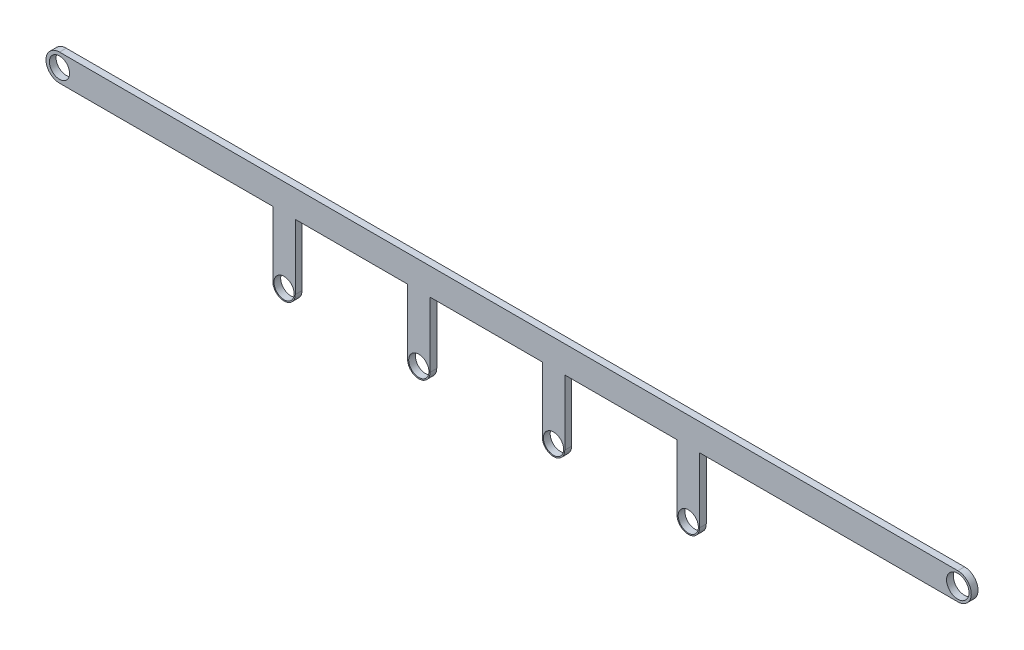
ISO-10303-21;
HEADER;
FILE_DESCRIPTION(('STEP AP214'),'2;1');
FILE_NAME('part.step','',(''),(''),'','','');
FILE_SCHEMA(('AUTOMOTIVE_DESIGN { 1 0 10303 214 1 1 1 1 }'));
ENDSEC;
DATA;
#1=APPLICATION_CONTEXT('core data for automotive mechanical design processes');
#2=APPLICATION_PROTOCOL_DEFINITION('international standard','automotive_design',2000,#1);
#3=PRODUCT_CONTEXT('',#1,'mechanical');
#4=PRODUCT('Part','Part','',(#3));
#5=PRODUCT_RELATED_PRODUCT_CATEGORY('part','',(#4));
#6=PRODUCT_DEFINITION_FORMATION('','',#4);
#7=PRODUCT_DEFINITION_CONTEXT('part definition',#1,'design');
#8=PRODUCT_DEFINITION('design','',#6,#7);
#9=PRODUCT_DEFINITION_SHAPE('','',#8);
#10=(LENGTH_UNIT() NAMED_UNIT(*) SI_UNIT(.MILLI.,.METRE.));
#11=(NAMED_UNIT(*) PLANE_ANGLE_UNIT() SI_UNIT($,.RADIAN.));
#12=(NAMED_UNIT(*) SI_UNIT($,.STERADIAN.) SOLID_ANGLE_UNIT());
#13=UNCERTAINTY_MEASURE_WITH_UNIT(LENGTH_MEASURE(1.E-05),#10,'distance_accuracy_value','');
#14=(GEOMETRIC_REPRESENTATION_CONTEXT(3) GLOBAL_UNCERTAINTY_ASSIGNED_CONTEXT((#13)) GLOBAL_UNIT_ASSIGNED_CONTEXT((#10,
#11,#12)) REPRESENTATION_CONTEXT('',''));
#15=CARTESIAN_POINT('',(0.,0.,0.));
#16=DIRECTION('',(0.,0.,1.));
#17=DIRECTION('',(1.,0.,0.));
#18=AXIS2_PLACEMENT_3D('',#15,#16,#17);
#19=CARTESIAN_POINT('',(159.999999999998,-35.0000000000009,3.));
#20=DIRECTION('',(0.,0.,-1.));
#21=DIRECTION('',(-1.,0.,0.));
#22=AXIS2_PLACEMENT_3D('',#19,#20,#21);
#23=CYLINDRICAL_SURFACE('',#22,4.50000000000002);
#24=CARTESIAN_POINT('',(159.999999999998,-35.0000000000009,3.));
#25=DIRECTION('',(0.,0.,1.));
#26=DIRECTION('',(1.,0.,0.));
#27=AXIS2_PLACEMENT_3D('',#24,#25,#26);
#28=CIRCLE('',#27,4.50000000000002);
#29=CARTESIAN_POINT('',(164.499999999998,-35.0000000000009,3.));
#30=VERTEX_POINT('',#29);
#31=EDGE_CURVE('E574',#30,#30,#28,.T.);
#32=ORIENTED_EDGE('',*,*,#31,.T.);
#33=EDGE_LOOP('',(#32));
#34=FACE_BOUND('',#33,.T.);
#35=CARTESIAN_POINT('',(159.999999999998,-35.0000000000009,0.));
#36=DIRECTION('',(0.,0.,1.));
#37=DIRECTION('',(1.,0.,0.));
#38=AXIS2_PLACEMENT_3D('',#35,#36,#37);
#39=CIRCLE('',#38,4.50000000000002);
#40=CARTESIAN_POINT('',(164.499999999998,-35.0000000000009,0.));
#41=VERTEX_POINT('',#40);
#42=EDGE_CURVE('E575',#41,#41,#39,.T.);
#43=ORIENTED_EDGE('',*,*,#42,.F.);
#44=EDGE_LOOP('',(#43));
#45=FACE_BOUND('',#44,.T.);
#46=ADVANCED_FACE('F345',(#34,#45),#23,.F.);
#47=CARTESIAN_POINT('',(219.999999999998,-35.0000000000004,3.));
#48=DIRECTION('',(0.,0.,-1.));
#49=DIRECTION('',(-1.,0.,0.));
#50=AXIS2_PLACEMENT_3D('',#47,#48,#49);
#51=CYLINDRICAL_SURFACE('',#50,4.50000000000002);
#52=CARTESIAN_POINT('',(219.999999999998,-35.0000000000004,3.));
#53=DIRECTION('',(0.,0.,1.));
#54=DIRECTION('',(1.,0.,0.));
#55=AXIS2_PLACEMENT_3D('',#52,#53,#54);
#56=CIRCLE('',#55,4.50000000000002);
#57=CARTESIAN_POINT('',(224.499999999998,-35.0000000000004,3.));
#58=VERTEX_POINT('',#57);
#59=EDGE_CURVE('E644',#58,#58,#56,.T.);
#60=ORIENTED_EDGE('',*,*,#59,.T.);
#61=EDGE_LOOP('',(#60));
#62=FACE_BOUND('',#61,.T.);
#63=CARTESIAN_POINT('',(219.999999999998,-35.0000000000004,0.));
#64=DIRECTION('',(0.,0.,1.));
#65=DIRECTION('',(1.,0.,0.));
#66=AXIS2_PLACEMENT_3D('',#63,#64,#65);
#67=CIRCLE('',#66,4.50000000000002);
#68=CARTESIAN_POINT('',(224.499999999998,-35.0000000000004,0.));
#69=VERTEX_POINT('',#68);
#70=EDGE_CURVE('E580',#69,#69,#67,.T.);
#71=ORIENTED_EDGE('',*,*,#70,.F.);
#72=EDGE_LOOP('',(#71));
#73=FACE_BOUND('',#72,.T.);
#74=ADVANCED_FACE('F827',(#62,#73),#51,.F.);
#75=CARTESIAN_POINT('',(0.,0.,3.));
#76=DIRECTION('',(0.,0.,-1.));
#77=DIRECTION('',(-1.,0.,0.));
#78=AXIS2_PLACEMENT_3D('',#75,#76,#77);
#79=CYLINDRICAL_SURFACE('',#78,4.5);
#80=CARTESIAN_POINT('',(0.,0.,3.));
#81=DIRECTION('',(0.,0.,1.));
#82=DIRECTION('',(1.,0.,0.));
#83=AXIS2_PLACEMENT_3D('',#80,#81,#82);
#84=CIRCLE('',#83,4.5);
#85=CARTESIAN_POINT('',(4.5,0.,3.));
#86=VERTEX_POINT('',#85);
#87=EDGE_CURVE('E648',#86,#86,#84,.T.);
#88=ORIENTED_EDGE('',*,*,#87,.T.);
#89=EDGE_LOOP('',(#88));
#90=FACE_BOUND('',#89,.T.);
#91=CARTESIAN_POINT('',(0.,0.,0.));
#92=DIRECTION('',(0.,0.,1.));
#93=DIRECTION('',(1.,0.,0.));
#94=AXIS2_PLACEMENT_3D('',#91,#92,#93);
#95=CIRCLE('',#94,4.5);
#96=CARTESIAN_POINT('',(4.5,0.,0.));
#97=VERTEX_POINT('',#96);
#98=EDGE_CURVE('E584',#97,#97,#95,.T.);
#99=ORIENTED_EDGE('',*,*,#98,.F.);
#100=EDGE_LOOP('',(#99));
#101=FACE_BOUND('',#100,.T.);
#102=ADVANCED_FACE('F833',(#90,#101),#79,.F.);
#103=CARTESIAN_POINT('',(400.,0.,3.));
#104=DIRECTION('',(0.,0.,-1.));
#105=DIRECTION('',(-1.,0.,0.));
#106=AXIS2_PLACEMENT_3D('',#103,#104,#105);
#107=CYLINDRICAL_SURFACE('',#106,5.00000000006176);
#108=CARTESIAN_POINT('',(400.,0.,3.));
#109=DIRECTION('',(0.,0.,1.));
#110=DIRECTION('',(1.,0.,0.));
#111=AXIS2_PLACEMENT_3D('',#108,#109,#110);
#112=CIRCLE('',#111,5.00000000006176);
#113=CARTESIAN_POINT('',(405.000000000062,0.,3.));
#114=VERTEX_POINT('',#113);
#115=EDGE_CURVE('E652',#114,#114,#112,.T.);
#116=ORIENTED_EDGE('',*,*,#115,.T.);
#117=EDGE_LOOP('',(#116));
#118=FACE_BOUND('',#117,.T.);
#119=CARTESIAN_POINT('',(400.,0.,0.));
#120=DIRECTION('',(0.,0.,1.));
#121=DIRECTION('',(1.,0.,0.));
#122=AXIS2_PLACEMENT_3D('',#119,#120,#121);
#123=CIRCLE('',#122,5.00000000006176);
#124=CARTESIAN_POINT('',(405.000000000062,0.,0.));
#125=VERTEX_POINT('',#124);
#126=EDGE_CURVE('E588',#125,#125,#123,.T.);
#127=ORIENTED_EDGE('',*,*,#126,.F.);
#128=EDGE_LOOP('',(#127));
#129=FACE_BOUND('',#128,.T.);
#130=ADVANCED_FACE('F842',(#118,#129),#107,.F.);
#131=CARTESIAN_POINT('',(154.999999999999,-9.83340393239419E-13,3.));
#132=DIRECTION('',(1.,0.,0.));
#133=DIRECTION('',(0.,1.,0.));
#134=AXIS2_PLACEMENT_3D('',#131,#132,#133);
#135=PLANE('',#134);
#136=DIRECTION('',(0.,-1.,0.));
#137=VECTOR('',#136,1.);
#138=CARTESIAN_POINT('',(154.999999999999,-9.83340393239419E-13,0.));
#139=LINE('',#138,#137);
#140=CARTESIAN_POINT('',(154.999999999999,-6.,0.));
#141=VERTEX_POINT('',#140);
#142=CARTESIAN_POINT('',(154.999999999999,-35.0000000000009,0.));
#143=VERTEX_POINT('',#142);
#144=EDGE_CURVE('E635',#141,#143,#139,.T.);
#145=ORIENTED_EDGE('',*,*,#144,.T.);
#146=DIRECTION('',(0.,0.,-1.));
#147=VECTOR('',#146,1.);
#148=CARTESIAN_POINT('',(154.999999999999,-35.0000000000009,3.));
#149=LINE('',#148,#147);
#150=CARTESIAN_POINT('',(154.999999999999,-35.0000000000009,3.));
#151=VERTEX_POINT('',#150);
#152=EDGE_CURVE('E356',#151,#143,#149,.T.);
#153=ORIENTED_EDGE('',*,*,#152,.F.);
#154=DIRECTION('',(0.,-1.,0.));
#155=VECTOR('',#154,1.);
#156=CARTESIAN_POINT('',(154.999999999999,-9.83340393239419E-13,3.));
#157=LINE('',#156,#155);
#158=CARTESIAN_POINT('',(154.999999999999,-6.,3.));
#159=VERTEX_POINT('',#158);
#160=EDGE_CURVE('E704',#159,#151,#157,.T.);
#161=ORIENTED_EDGE('',*,*,#160,.F.);
#162=DIRECTION('',(0.,0.,-1.));
#163=VECTOR('',#162,1.);
#164=CARTESIAN_POINT('',(154.999999999999,-6.,3.));
#165=LINE('',#164,#163);
#166=EDGE_CURVE('E12',#159,#141,#165,.T.);
#167=ORIENTED_EDGE('',*,*,#166,.T.);
#168=EDGE_LOOP('',(#145,#153,#161,#167));
#169=FACE_BOUND('',#168,.T.);
#170=ADVANCED_FACE('F722',(#169),#135,.F.);
#171=CARTESIAN_POINT('',(159.999999999998,-35.0000000000009,3.));
#172=DIRECTION('',(0.,0.,-1.));
#173=DIRECTION('',(-1.,0.,0.));
#174=AXIS2_PLACEMENT_3D('',#171,#172,#173);
#175=CYLINDRICAL_SURFACE('',#174,4.99999999999934);
#176=CARTESIAN_POINT('',(159.999999999998,-35.0000000000009,0.));
#177=DIRECTION('',(0.,0.,1.));
#178=DIRECTION('',(1.,0.,0.));
#179=AXIS2_PLACEMENT_3D('',#176,#177,#178);
#180=CIRCLE('',#179,4.99999999999934);
#181=CARTESIAN_POINT('',(164.999999999998,-35.0000000000008,0.));
#182=VERTEX_POINT('',#181);
#183=EDGE_CURVE('E631',#143,#182,#180,.T.);
#184=ORIENTED_EDGE('',*,*,#183,.T.);
#185=DIRECTION('',(0.,0.,-1.));
#186=VECTOR('',#185,1.);
#187=CARTESIAN_POINT('',(164.999999999998,-35.0000000000008,3.));
#188=LINE('',#187,#186);
#189=CARTESIAN_POINT('',(164.999999999998,-35.0000000000008,3.));
#190=VERTEX_POINT('',#189);
#191=EDGE_CURVE('E530',#190,#182,#188,.T.);
#192=ORIENTED_EDGE('',*,*,#191,.F.);
#193=CARTESIAN_POINT('',(159.999999999998,-35.0000000000009,3.));
#194=DIRECTION('',(0.,0.,1.));
#195=DIRECTION('',(1.,0.,0.));
#196=AXIS2_PLACEMENT_3D('',#193,#194,#195);
#197=CIRCLE('',#196,4.99999999999934);
#198=EDGE_CURVE('E700',#151,#190,#197,.T.);
#199=ORIENTED_EDGE('',*,*,#198,.F.);
#200=ORIENTED_EDGE('',*,*,#152,.T.);
#201=EDGE_LOOP('',(#184,#192,#199,#200));
#202=FACE_BOUND('',#201,.T.);
#203=ADVANCED_FACE('F729',(#202),#175,.T.);
#204=CARTESIAN_POINT('',(164.999999999997,3.14034512679682E-12,3.));
#205=DIRECTION('',(1.,0.,0.));
#206=DIRECTION('',(0.,1.,0.));
#207=AXIS2_PLACEMENT_3D('',#204,#205,#206);
#208=PLANE('',#207);
#209=DIRECTION('',(0.,-1.,0.));
#210=VECTOR('',#209,1.);
#211=CARTESIAN_POINT('',(164.999999999997,3.14034512679682E-12,0.));
#212=LINE('',#211,#210);
#213=CARTESIAN_POINT('',(164.999999999997,-5.99999999999999,0.));
#214=VERTEX_POINT('',#213);
#215=EDGE_CURVE('E627',#214,#182,#212,.T.);
#216=ORIENTED_EDGE('',*,*,#215,.F.);
#217=DIRECTION('',(0.,0.,-1.));
#218=VECTOR('',#217,1.);
#219=CARTESIAN_POINT('',(164.999999999997,-5.99999999999999,3.));
#220=LINE('',#219,#218);
#221=CARTESIAN_POINT('',(164.999999999997,-5.99999999999999,3.));
#222=VERTEX_POINT('',#221);
#223=EDGE_CURVE('E533',#222,#214,#220,.T.);
#224=ORIENTED_EDGE('',*,*,#223,.F.);
#225=DIRECTION('',(0.,-1.,0.));
#226=VECTOR('',#225,1.);
#227=CARTESIAN_POINT('',(164.999999999997,3.14034512679682E-12,3.));
#228=LINE('',#227,#226);
#229=EDGE_CURVE('E696',#222,#190,#228,.T.);
#230=ORIENTED_EDGE('',*,*,#229,.T.);
#231=ORIENTED_EDGE('',*,*,#191,.T.);
#232=EDGE_LOOP('',(#216,#224,#230,#231));
#233=FACE_BOUND('',#232,.T.);
#234=ADVANCED_FACE('F771',(#233),#208,.T.);
#235=CARTESIAN_POINT('',(0.,-6.00000000000001,3.));
#236=DIRECTION('',(0.,1.,0.));
#237=DIRECTION('',(-1.,0.,0.));
#238=AXIS2_PLACEMENT_3D('',#235,#236,#237);
#239=PLANE('',#238);
#240=DIRECTION('',(1.,0.,0.));
#241=VECTOR('',#240,1.);
#242=CARTESIAN_POINT('',(0.,-6.00000000000001,0.));
#243=LINE('',#242,#241);
#244=CARTESIAN_POINT('',(214.999999999999,-5.99999999999999,0.));
#245=VERTEX_POINT('',#244);
#246=EDGE_CURVE('E624',#214,#245,#243,.T.);
#247=ORIENTED_EDGE('',*,*,#246,.T.);
#248=DIRECTION('',(0.,0.,-1.));
#249=VECTOR('',#248,1.);
#250=CARTESIAN_POINT('',(214.999999999999,-5.99999999999999,3.));
#251=LINE('',#250,#249);
#252=CARTESIAN_POINT('',(214.999999999999,-5.99999999999999,3.));
#253=VERTEX_POINT('',#252);
#254=EDGE_CURVE('E536',#253,#245,#251,.T.);
#255=ORIENTED_EDGE('',*,*,#254,.F.);
#256=DIRECTION('',(1.,0.,0.));
#257=VECTOR('',#256,1.);
#258=CARTESIAN_POINT('',(0.,-6.00000000000001,3.));
#259=LINE('',#258,#257);
#260=EDGE_CURVE('E692',#222,#253,#259,.T.);
#261=ORIENTED_EDGE('',*,*,#260,.F.);
#262=ORIENTED_EDGE('',*,*,#223,.T.);
#263=EDGE_LOOP('',(#247,#255,#261,#262));
#264=FACE_BOUND('',#263,.T.);
#265=ADVANCED_FACE('F775',(#264),#239,.F.);
#266=CARTESIAN_POINT('',(214.999999999999,-1.36398828739662E-12,3.));
#267=DIRECTION('',(1.,0.,0.));
#268=DIRECTION('',(0.,1.,0.));
#269=AXIS2_PLACEMENT_3D('',#266,#267,#268);
#270=PLANE('',#269);
#271=DIRECTION('',(0.,-1.,0.));
#272=VECTOR('',#271,1.);
#273=CARTESIAN_POINT('',(214.999999999999,-1.36398828739662E-12,0.));
#274=LINE('',#273,#272);
#275=CARTESIAN_POINT('',(214.999999999999,-35.0000000000004,0.));
#276=VERTEX_POINT('',#275);
#277=EDGE_CURVE('E621',#245,#276,#274,.T.);
#278=ORIENTED_EDGE('',*,*,#277,.T.);
#279=DIRECTION('',(0.,0.,-1.));
#280=VECTOR('',#279,1.);
#281=CARTESIAN_POINT('',(214.999999999999,-35.0000000000004,3.));
#282=LINE('',#281,#280);
#283=CARTESIAN_POINT('',(214.999999999999,-35.0000000000004,3.));
#284=VERTEX_POINT('',#283);
#285=EDGE_CURVE('E540',#284,#276,#282,.T.);
#286=ORIENTED_EDGE('',*,*,#285,.F.);
#287=DIRECTION('',(0.,-1.,0.));
#288=VECTOR('',#287,1.);
#289=CARTESIAN_POINT('',(214.999999999999,-1.36398828739662E-12,3.));
#290=LINE('',#289,#288);
#291=EDGE_CURVE('E688',#253,#284,#290,.T.);
#292=ORIENTED_EDGE('',*,*,#291,.F.);
#293=ORIENTED_EDGE('',*,*,#254,.T.);
#294=EDGE_LOOP('',(#278,#286,#292,#293));
#295=FACE_BOUND('',#294,.T.);
#296=ADVANCED_FACE('F782',(#295),#270,.F.);
#297=CARTESIAN_POINT('',(219.999999999998,-35.0000000000004,3.));
#298=DIRECTION('',(0.,0.,-1.));
#299=DIRECTION('',(-1.,0.,0.));
#300=AXIS2_PLACEMENT_3D('',#297,#298,#299);
#301=CYLINDRICAL_SURFACE('',#300,4.99999999999934);
#302=CARTESIAN_POINT('',(219.999999999998,-35.0000000000004,0.));
#303=DIRECTION('',(0.,0.,1.));
#304=DIRECTION('',(1.,0.,0.));
#305=AXIS2_PLACEMENT_3D('',#302,#303,#304);
#306=CIRCLE('',#305,4.99999999999934);
#307=CARTESIAN_POINT('',(224.999999999998,-35.0000000000004,0.));
#308=VERTEX_POINT('',#307);
#309=EDGE_CURVE('E617',#276,#308,#306,.T.);
#310=ORIENTED_EDGE('',*,*,#309,.T.);
#311=DIRECTION('',(0.,0.,-1.));
#312=VECTOR('',#311,1.);
#313=CARTESIAN_POINT('',(224.999999999998,-35.0000000000004,3.));
#314=LINE('',#313,#312);
#315=CARTESIAN_POINT('',(224.999999999998,-35.0000000000004,3.));
#316=VERTEX_POINT('',#315);
#317=EDGE_CURVE('E544',#316,#308,#314,.T.);
#318=ORIENTED_EDGE('',*,*,#317,.F.);
#319=CARTESIAN_POINT('',(219.999999999998,-35.0000000000004,3.));
#320=DIRECTION('',(0.,0.,1.));
#321=DIRECTION('',(1.,0.,0.));
#322=AXIS2_PLACEMENT_3D('',#319,#320,#321);
#323=CIRCLE('',#322,4.99999999999934);
#324=EDGE_CURVE('E684',#284,#316,#323,.T.);
#325=ORIENTED_EDGE('',*,*,#324,.F.);
#326=ORIENTED_EDGE('',*,*,#285,.T.);
#327=EDGE_LOOP('',(#310,#318,#325,#326));
#328=FACE_BOUND('',#327,.T.);
#329=ADVANCED_FACE('F785',(#328),#301,.T.);
#330=CARTESIAN_POINT('',(224.999999999997,4.28228880926841E-12,3.));
#331=DIRECTION('',(1.,0.,0.));
#332=DIRECTION('',(0.,1.,0.));
#333=AXIS2_PLACEMENT_3D('',#330,#331,#332);
#334=PLANE('',#333);
#335=DIRECTION('',(0.,-1.,0.));
#336=VECTOR('',#335,1.);
#337=CARTESIAN_POINT('',(224.999999999997,4.28228880926841E-12,0.));
#338=LINE('',#337,#336);
#339=CARTESIAN_POINT('',(224.999999999997,-5.99999999999999,0.));
#340=VERTEX_POINT('',#339);
#341=EDGE_CURVE('E613',#340,#308,#338,.T.);
#342=ORIENTED_EDGE('',*,*,#341,.F.);
#343=DIRECTION('',(0.,0.,-1.));
#344=VECTOR('',#343,1.);
#345=CARTESIAN_POINT('',(224.999999999997,-5.99999999999999,3.));
#346=LINE('',#345,#344);
#347=CARTESIAN_POINT('',(224.999999999997,-5.99999999999999,3.));
#348=VERTEX_POINT('',#347);
#349=EDGE_CURVE('E547',#348,#340,#346,.T.);
#350=ORIENTED_EDGE('',*,*,#349,.F.);
#351=DIRECTION('',(0.,-1.,0.));
#352=VECTOR('',#351,1.);
#353=CARTESIAN_POINT('',(224.999999999997,4.28228880926841E-12,3.));
#354=LINE('',#353,#352);
#355=EDGE_CURVE('E680',#348,#316,#354,.T.);
#356=ORIENTED_EDGE('',*,*,#355,.T.);
#357=ORIENTED_EDGE('',*,*,#317,.T.);
#358=EDGE_LOOP('',(#342,#350,#356,#357));
#359=FACE_BOUND('',#358,.T.);
#360=ADVANCED_FACE('F788',(#359),#334,.T.);
#361=CARTESIAN_POINT('',(0.,-6.00000000000001,3.));
#362=DIRECTION('',(0.,1.,0.));
#363=DIRECTION('',(-1.,0.,0.));
#364=AXIS2_PLACEMENT_3D('',#361,#362,#363);
#365=PLANE('',#364);
#366=DIRECTION('',(1.,0.,0.));
#367=VECTOR('',#366,1.);
#368=CARTESIAN_POINT('',(0.,-6.00000000000001,0.));
#369=LINE('',#368,#367);
#370=CARTESIAN_POINT('',(274.999999999999,-5.99999999999999,0.));
#371=VERTEX_POINT('',#370);
#372=EDGE_CURVE('E609',#340,#371,#369,.T.);
#373=ORIENTED_EDGE('',*,*,#372,.T.);
#374=DIRECTION('',(0.,0.,-1.));
#375=VECTOR('',#374,1.);
#376=CARTESIAN_POINT('',(274.999999999999,-5.99999999999999,3.));
#377=LINE('',#376,#375);
#378=CARTESIAN_POINT('',(274.999999999999,-5.99999999999999,3.));
#379=VERTEX_POINT('',#378);
#380=EDGE_CURVE('E550',#379,#371,#377,.T.);
#381=ORIENTED_EDGE('',*,*,#380,.F.);
#382=DIRECTION('',(1.,0.,0.));
#383=VECTOR('',#382,1.);
#384=CARTESIAN_POINT('',(0.,-6.00000000000001,3.));
#385=LINE('',#384,#383);
#386=EDGE_CURVE('E676',#348,#379,#385,.T.);
#387=ORIENTED_EDGE('',*,*,#386,.F.);
#388=ORIENTED_EDGE('',*,*,#349,.T.);
#389=EDGE_LOOP('',(#373,#381,#387,#388));
#390=FACE_BOUND('',#389,.T.);
#391=ADVANCED_FACE('F793',(#390),#365,.F.);
#392=CARTESIAN_POINT('',(0.,-5.99999999999999,3.));
#393=DIRECTION('',(0.,1.,0.));
#394=DIRECTION('',(0.,0.,1.));
#395=AXIS2_PLACEMENT_3D('',#392,#393,#394);
#396=PLANE('',#395);
#397=DIRECTION('',(1.,0.,0.));
#398=VECTOR('',#397,1.);
#399=CARTESIAN_POINT('',(0.,-5.99999999999999,0.));
#400=LINE('',#399,#398);
#401=CARTESIAN_POINT('',(284.999999999997,-5.99999999999999,0.));
#402=VERTEX_POINT('',#401);
#403=CARTESIAN_POINT('',(400.,-5.99999999999999,0.));
#404=VERTEX_POINT('',#403);
#405=EDGE_CURVE('E606',#402,#404,#400,.T.);
#406=ORIENTED_EDGE('',*,*,#405,.T.);
#407=DIRECTION('',(0.,0.,-1.));
#408=VECTOR('',#407,1.);
#409=CARTESIAN_POINT('',(400.,-5.99999999999999,3.));
#410=LINE('',#409,#408);
#411=CARTESIAN_POINT('',(400.,-5.99999999999999,3.));
#412=VERTEX_POINT('',#411);
#413=EDGE_CURVE('E556',#412,#404,#410,.T.);
#414=ORIENTED_EDGE('',*,*,#413,.F.);
#415=DIRECTION('',(1.,0.,0.));
#416=VECTOR('',#415,1.);
#417=CARTESIAN_POINT('',(0.,-5.99999999999999,3.));
#418=LINE('',#417,#416);
#419=CARTESIAN_POINT('',(284.999999999997,-5.99999999999999,3.));
#420=VERTEX_POINT('',#419);
#421=EDGE_CURVE('E672',#420,#412,#418,.T.);
#422=ORIENTED_EDGE('',*,*,#421,.F.);
#423=DIRECTION('',(0.,0.,-1.));
#424=VECTOR('',#423,1.);
#425=CARTESIAN_POINT('',(284.999999999997,-5.99999999999999,3.));
#426=LINE('',#425,#424);
#427=EDGE_CURVE('E553',#420,#402,#426,.T.);
#428=ORIENTED_EDGE('',*,*,#427,.T.);
#429=EDGE_LOOP('',(#406,#414,#422,#428));
#430=FACE_BOUND('',#429,.T.);
#431=ADVANCED_FACE('F807',(#430),#396,.F.);
#432=CARTESIAN_POINT('',(400.,0.,3.));
#433=DIRECTION('',(0.,0.,-1.));
#434=DIRECTION('',(-1.,0.,0.));
#435=AXIS2_PLACEMENT_3D('',#432,#433,#434);
#436=CYLINDRICAL_SURFACE('',#435,6.);
#437=CARTESIAN_POINT('',(400.,0.,0.));
#438=DIRECTION('',(0.,0.,1.));
#439=DIRECTION('',(1.,0.,0.));
#440=AXIS2_PLACEMENT_3D('',#437,#438,#439);
#441=CIRCLE('',#440,6.);
#442=CARTESIAN_POINT('',(400.,6.00000000000002,0.));
#443=VERTEX_POINT('',#442);
#444=EDGE_CURVE('E602',#404,#443,#441,.T.);
#445=ORIENTED_EDGE('',*,*,#444,.T.);
#446=DIRECTION('',(0.,0.,-1.));
#447=VECTOR('',#446,1.);
#448=CARTESIAN_POINT('',(400.,6.00000000000002,3.));
#449=LINE('',#448,#447);
#450=CARTESIAN_POINT('',(400.,6.00000000000002,3.));
#451=VERTEX_POINT('',#450);
#452=EDGE_CURVE('E560',#451,#443,#449,.T.);
#453=ORIENTED_EDGE('',*,*,#452,.F.);
#454=CARTESIAN_POINT('',(400.,0.,3.));
#455=DIRECTION('',(0.,0.,1.));
#456=DIRECTION('',(1.,0.,0.));
#457=AXIS2_PLACEMENT_3D('',#454,#455,#456);
#458=CIRCLE('',#457,6.);
#459=EDGE_CURVE('E668',#412,#451,#458,.T.);
#460=ORIENTED_EDGE('',*,*,#459,.F.);
#461=ORIENTED_EDGE('',*,*,#413,.T.);
#462=EDGE_LOOP('',(#445,#453,#460,#461));
#463=FACE_BOUND('',#462,.T.);
#464=ADVANCED_FACE('F814',(#463),#436,.T.);
#465=CARTESIAN_POINT('',(0.,6.00000000000002,3.));
#466=DIRECTION('',(0.,1.,0.));
#467=DIRECTION('',(0.,0.,1.));
#468=AXIS2_PLACEMENT_3D('',#465,#466,#467);
#469=PLANE('',#468);
#470=DIRECTION('',(1.,0.,0.));
#471=VECTOR('',#470,1.);
#472=CARTESIAN_POINT('',(0.,6.00000000000002,0.));
#473=LINE('',#472,#471);
#474=CARTESIAN_POINT('',(0.,6.00000000000002,0.));
#475=VERTEX_POINT('',#474);
#476=EDGE_CURVE('E598',#475,#443,#473,.T.);
#477=ORIENTED_EDGE('',*,*,#476,.F.);
#478=DIRECTION('',(0.,0.,-1.));
#479=VECTOR('',#478,1.);
#480=CARTESIAN_POINT('',(0.,6.00000000000002,3.));
#481=LINE('',#480,#479);
#482=CARTESIAN_POINT('',(0.,6.00000000000002,3.));
#483=VERTEX_POINT('',#482);
#484=EDGE_CURVE('E563',#483,#475,#481,.T.);
#485=ORIENTED_EDGE('',*,*,#484,.F.);
#486=DIRECTION('',(1.,0.,0.));
#487=VECTOR('',#486,1.);
#488=CARTESIAN_POINT('',(0.,6.00000000000002,3.));
#489=LINE('',#488,#487);
#490=EDGE_CURVE('E664',#483,#451,#489,.T.);
#491=ORIENTED_EDGE('',*,*,#490,.T.);
#492=ORIENTED_EDGE('',*,*,#452,.T.);
#493=EDGE_LOOP('',(#477,#485,#491,#492));
#494=FACE_BOUND('',#493,.T.);
#495=ADVANCED_FACE('F817',(#494),#469,.T.);
#496=CARTESIAN_POINT('',(0.,0.,3.));
#497=DIRECTION('',(0.,0.,-1.));
#498=DIRECTION('',(-1.,0.,0.));
#499=AXIS2_PLACEMENT_3D('',#496,#497,#498);
#500=CYLINDRICAL_SURFACE('',#499,6.00000000000002);
#501=CARTESIAN_POINT('',(0.,0.,0.));
#502=DIRECTION('',(0.,0.,1.));
#503=DIRECTION('',(1.,0.,0.));
#504=AXIS2_PLACEMENT_3D('',#501,#502,#503);
#505=CIRCLE('',#504,6.00000000000002);
#506=CARTESIAN_POINT('',(1.77635683793745E-12,-6.00000000000002,0.));
#507=VERTEX_POINT('',#506);
#508=EDGE_CURVE('E595',#475,#507,#505,.T.);
#509=ORIENTED_EDGE('',*,*,#508,.T.);
#510=DIRECTION('',(0.,0.,-1.));
#511=VECTOR('',#510,1.);
#512=CARTESIAN_POINT('',(1.77635683793745E-12,-6.00000000000002,3.));
#513=LINE('',#512,#511);
#514=CARTESIAN_POINT('',(1.77635683793745E-12,-6.00000000000002,3.));
#515=VERTEX_POINT('',#514);
#516=EDGE_CURVE('E566',#515,#507,#513,.T.);
#517=ORIENTED_EDGE('',*,*,#516,.F.);
#518=CARTESIAN_POINT('',(0.,0.,3.));
#519=DIRECTION('',(0.,0.,1.));
#520=DIRECTION('',(1.,0.,0.));
#521=AXIS2_PLACEMENT_3D('',#518,#519,#520);
#522=CIRCLE('',#521,6.00000000000002);
#523=EDGE_CURVE('E660',#483,#515,#522,.T.);
#524=ORIENTED_EDGE('',*,*,#523,.F.);
#525=ORIENTED_EDGE('',*,*,#484,.T.);
#526=EDGE_LOOP('',(#509,#517,#524,#525));
#527=FACE_BOUND('',#526,.T.);
#528=ADVANCED_FACE('F762',(#527),#500,.T.);
#529=CARTESIAN_POINT('',(0.,-6.00000000000002,3.));
#530=DIRECTION('',(0.,1.,0.));
#531=DIRECTION('',(-1.,0.,0.));
#532=AXIS2_PLACEMENT_3D('',#529,#530,#531);
#533=PLANE('',#532);
#534=DIRECTION('',(1.,0.,0.));
#535=VECTOR('',#534,1.);
#536=CARTESIAN_POINT('',(0.,-6.00000000000002,0.));
#537=LINE('',#536,#535);
#538=CARTESIAN_POINT('',(94.9999999999992,-6.,0.));
#539=VERTEX_POINT('',#538);
#540=EDGE_CURVE('E592',#507,#539,#537,.T.);
#541=ORIENTED_EDGE('',*,*,#540,.T.);
#542=DIRECTION('',(0.,0.,-1.));
#543=VECTOR('',#542,1.);
#544=CARTESIAN_POINT('',(94.9999999999992,-6.,3.));
#545=LINE('',#544,#543);
#546=CARTESIAN_POINT('',(94.9999999999992,-6.,3.));
#547=VERTEX_POINT('',#546);
#548=EDGE_CURVE('E453',#547,#539,#545,.T.);
#549=ORIENTED_EDGE('',*,*,#548,.F.);
#550=DIRECTION('',(1.,0.,0.));
#551=VECTOR('',#550,1.);
#552=CARTESIAN_POINT('',(0.,-6.00000000000002,3.));
#553=LINE('',#552,#551);
#554=EDGE_CURVE('E656',#515,#547,#553,.T.);
#555=ORIENTED_EDGE('',*,*,#554,.F.);
#556=ORIENTED_EDGE('',*,*,#516,.T.);
#557=EDGE_LOOP('',(#541,#549,#555,#556));
#558=FACE_BOUND('',#557,.T.);
#559=ADVANCED_FACE('F765',(#558),#533,.F.);
#560=CARTESIAN_POINT('',(0.,-6.00000000000001,3.));
#561=DIRECTION('',(0.,1.,0.));
#562=DIRECTION('',(-1.,0.,0.));
#563=AXIS2_PLACEMENT_3D('',#560,#561,#562);
#564=PLANE('',#563);
#565=DIRECTION('',(1.,0.,0.));
#566=VECTOR('',#565,1.);
#567=CARTESIAN_POINT('',(0.,-6.00000000000001,0.));
#568=LINE('',#567,#566);
#569=CARTESIAN_POINT('',(104.999999999997,-6.,0.));
#570=VERTEX_POINT('',#569);
#571=EDGE_CURVE('E495',#570,#141,#568,.T.);
#572=ORIENTED_EDGE('',*,*,#571,.T.);
#573=ORIENTED_EDGE('',*,*,#166,.F.);
#574=DIRECTION('',(1.,0.,0.));
#575=VECTOR('',#574,1.);
#576=CARTESIAN_POINT('',(0.,-6.00000000000001,3.));
#577=LINE('',#576,#575);
#578=CARTESIAN_POINT('',(104.999999999997,-6.,3.));
#579=VERTEX_POINT('',#578);
#580=EDGE_CURVE('E579',#579,#159,#577,.T.);
#581=ORIENTED_EDGE('',*,*,#580,.F.);
#582=DIRECTION('',(0.,0.,-1.));
#583=VECTOR('',#582,1.);
#584=CARTESIAN_POINT('',(104.999999999997,-6.,3.));
#585=LINE('',#584,#583);
#586=EDGE_CURVE('E365',#579,#570,#585,.T.);
#587=ORIENTED_EDGE('',*,*,#586,.T.);
#588=EDGE_LOOP('',(#572,#573,#581,#587));
#589=FACE_BOUND('',#588,.T.);
#590=ADVANCED_FACE('F720',(#589),#564,.F.);
#591=CARTESIAN_POINT('',(0.,0.,0.));
#592=DIRECTION('',(0.,0.,1.));
#593=DIRECTION('',(1.,0.,0.));
#594=AXIS2_PLACEMENT_3D('',#591,#592,#593);
#595=PLANE('',#594);
#596=DIRECTION('',(0.,-1.,0.));
#597=VECTOR('',#596,1.);
#598=CARTESIAN_POINT('',(274.999999999999,0.,0.));
#599=LINE('',#598,#597);
#600=CARTESIAN_POINT('',(274.999999999999,-35.,0.));
#601=VERTEX_POINT('',#600);
#602=EDGE_CURVE('E509',#371,#601,#599,.T.);
#603=ORIENTED_EDGE('',*,*,#602,.F.);
#604=ORIENTED_EDGE('',*,*,#372,.F.);
#605=ORIENTED_EDGE('',*,*,#341,.T.);
#606=ORIENTED_EDGE('',*,*,#309,.F.);
#607=ORIENTED_EDGE('',*,*,#277,.F.);
#608=ORIENTED_EDGE('',*,*,#246,.F.);
#609=ORIENTED_EDGE('',*,*,#215,.T.);
#610=ORIENTED_EDGE('',*,*,#183,.F.);
#611=ORIENTED_EDGE('',*,*,#144,.F.);
#612=ORIENTED_EDGE('',*,*,#571,.F.);
#613=DIRECTION('',(0.,-1.,0.));
#614=VECTOR('',#613,1.);
#615=CARTESIAN_POINT('',(104.999999999997,-1.25693328198351E-12,0.));
#616=LINE('',#615,#614);
#617=CARTESIAN_POINT('',(104.999999999997,-35.0000000000013,0.));
#618=VERTEX_POINT('',#617);
#619=EDGE_CURVE('E441',#570,#618,#616,.T.);
#620=ORIENTED_EDGE('',*,*,#619,.T.);
#621=CARTESIAN_POINT('',(99.9999999999976,-35.0000000000013,0.));
#622=DIRECTION('',(0.,0.,1.));
#623=DIRECTION('',(1.,0.,0.));
#624=AXIS2_PLACEMENT_3D('',#621,#622,#623);
#625=CIRCLE('',#624,4.99999999999934);
#626=CARTESIAN_POINT('',(94.999999999999,-35.0000000000013,0.));
#627=VERTEX_POINT('',#626);
#628=EDGE_CURVE('E458',#627,#618,#625,.T.);
#629=ORIENTED_EDGE('',*,*,#628,.F.);
#630=DIRECTION('',(0.,-1.,0.));
#631=VECTOR('',#630,1.);
#632=CARTESIAN_POINT('',(94.9999999999992,-1.25693328198351E-12,0.));
#633=LINE('',#632,#631);
#634=EDGE_CURVE('E447',#539,#627,#633,.T.);
#635=ORIENTED_EDGE('',*,*,#634,.F.);
#636=ORIENTED_EDGE('',*,*,#540,.F.);
#637=ORIENTED_EDGE('',*,*,#508,.F.);
#638=ORIENTED_EDGE('',*,*,#476,.T.);
#639=ORIENTED_EDGE('',*,*,#444,.F.);
#640=ORIENTED_EDGE('',*,*,#405,.F.);
#641=DIRECTION('',(0.,-1.,0.));
#642=VECTOR('',#641,1.);
#643=CARTESIAN_POINT('',(284.999999999997,0.,0.));
#644=LINE('',#643,#642);
#645=CARTESIAN_POINT('',(284.999999999997,-35.,0.));
#646=VERTEX_POINT('',#645);
#647=EDGE_CURVE('E501',#402,#646,#644,.T.);
#648=ORIENTED_EDGE('',*,*,#647,.T.);
#649=CARTESIAN_POINT('',(279.999999999998,-35.,0.));
#650=DIRECTION('',(0.,0.,1.));
#651=DIRECTION('',(1.,0.,0.));
#652=AXIS2_PLACEMENT_3D('',#649,#650,#651);
#653=CIRCLE('',#652,4.99999999999934);
#654=EDGE_CURVE('E505',#601,#646,#653,.T.);
#655=ORIENTED_EDGE('',*,*,#654,.F.);
#656=EDGE_LOOP('',(#603,#604,#605,#606,#607,#608,#609,#610,#611,#612,#620,#629,#635,#636,#637,
#638,#639,#640,#648,#655));
#657=FACE_BOUND('',#656,.T.);
#658=ORIENTED_EDGE('',*,*,#126,.T.);
#659=EDGE_LOOP('',(#658));
#660=FACE_BOUND('',#659,.T.);
#661=ORIENTED_EDGE('',*,*,#98,.T.);
#662=EDGE_LOOP('',(#661));
#663=FACE_BOUND('',#662,.T.);
#664=ORIENTED_EDGE('',*,*,#70,.T.);
#665=EDGE_LOOP('',(#664));
#666=FACE_BOUND('',#665,.T.);
#667=ORIENTED_EDGE('',*,*,#42,.T.);
#668=EDGE_LOOP('',(#667));
#669=FACE_BOUND('',#668,.T.);
#670=CARTESIAN_POINT('',(99.9999999999976,-35.0000000000013,0.));
#671=DIRECTION('',(0.,0.,1.));
#672=DIRECTION('',(1.,0.,0.));
#673=AXIS2_PLACEMENT_3D('',#670,#671,#672);
#674=CIRCLE('',#673,4.50000000000002);
#675=CARTESIAN_POINT('',(104.499999999998,-35.0000000000013,0.));
#676=VERTEX_POINT('',#675);
#677=EDGE_CURVE('E484',#676,#676,#674,.T.);
#678=ORIENTED_EDGE('',*,*,#677,.T.);
#679=EDGE_LOOP('',(#678));
#680=FACE_BOUND('',#679,.T.);
#681=CARTESIAN_POINT('',(279.999999999998,-35.,0.));
#682=DIRECTION('',(0.,0.,1.));
#683=DIRECTION('',(1.,0.,0.));
#684=AXIS2_PLACEMENT_3D('',#681,#682,#683);
#685=CIRCLE('',#684,4.50000000000002);
#686=CARTESIAN_POINT('',(284.499999999998,-35.,0.));
#687=VERTEX_POINT('',#686);
#688=EDGE_CURVE('E467',#687,#687,#685,.T.);
#689=ORIENTED_EDGE('',*,*,#688,.T.);
#690=EDGE_LOOP('',(#689));
#691=FACE_BOUND('',#690,.T.);
#692=ADVANCED_FACE('F469',(#657,#660,#663,#666,#669,#680,#691),#595,.F.);
#693=CARTESIAN_POINT('',(0.,0.,3.));
#694=DIRECTION('',(0.,0.,1.));
#695=DIRECTION('',(1.,0.,0.));
#696=AXIS2_PLACEMENT_3D('',#693,#694,#695);
#697=PLANE('',#696);
#698=ORIENTED_EDGE('',*,*,#386,.T.);
#699=DIRECTION('',(0.,-1.,0.));
#700=VECTOR('',#699,1.);
#701=CARTESIAN_POINT('',(274.999999999999,0.,3.));
#702=LINE('',#701,#700);
#703=CARTESIAN_POINT('',(274.999999999999,-35.,3.));
#704=VERTEX_POINT('',#703);
#705=EDGE_CURVE('E504',#379,#704,#702,.T.);
#706=ORIENTED_EDGE('',*,*,#705,.T.);
#707=CARTESIAN_POINT('',(279.999999999998,-35.,3.));
#708=DIRECTION('',(0.,0.,1.));
#709=DIRECTION('',(1.,0.,0.));
#710=AXIS2_PLACEMENT_3D('',#707,#708,#709);
#711=CIRCLE('',#710,4.99999999999934);
#712=CARTESIAN_POINT('',(284.999999999997,-35.,3.));
#713=VERTEX_POINT('',#712);
#714=EDGE_CURVE('E515',#704,#713,#711,.T.);
#715=ORIENTED_EDGE('',*,*,#714,.T.);
#716=DIRECTION('',(0.,-1.,0.));
#717=VECTOR('',#716,1.);
#718=CARTESIAN_POINT('',(284.999999999997,0.,3.));
#719=LINE('',#718,#717);
#720=EDGE_CURVE('E500',#420,#713,#719,.T.);
#721=ORIENTED_EDGE('',*,*,#720,.F.);
#722=ORIENTED_EDGE('',*,*,#421,.T.);
#723=ORIENTED_EDGE('',*,*,#459,.T.);
#724=ORIENTED_EDGE('',*,*,#490,.F.);
#725=ORIENTED_EDGE('',*,*,#523,.T.);
#726=ORIENTED_EDGE('',*,*,#554,.T.);
#727=DIRECTION('',(0.,-1.,0.));
#728=VECTOR('',#727,1.);
#729=CARTESIAN_POINT('',(94.9999999999992,-1.25693328198351E-12,3.));
#730=LINE('',#729,#728);
#731=CARTESIAN_POINT('',(94.999999999999,-35.0000000000013,3.));
#732=VERTEX_POINT('',#731);
#733=EDGE_CURVE('E477',#547,#732,#730,.T.);
#734=ORIENTED_EDGE('',*,*,#733,.T.);
#735=CARTESIAN_POINT('',(99.9999999999976,-35.0000000000013,3.));
#736=DIRECTION('',(0.,0.,1.));
#737=DIRECTION('',(1.,0.,0.));
#738=AXIS2_PLACEMENT_3D('',#735,#736,#737);
#739=CIRCLE('',#738,4.99999999999934);
#740=CARTESIAN_POINT('',(104.999999999997,-35.0000000000013,3.));
#741=VERTEX_POINT('',#740);
#742=EDGE_CURVE('E465',#732,#741,#739,.T.);
#743=ORIENTED_EDGE('',*,*,#742,.T.);
#744=DIRECTION('',(0.,-1.,0.));
#745=VECTOR('',#744,1.);
#746=CARTESIAN_POINT('',(104.999999999997,-1.25693328198351E-12,3.));
#747=LINE('',#746,#745);
#748=EDGE_CURVE('E457',#579,#741,#747,.T.);
#749=ORIENTED_EDGE('',*,*,#748,.F.);
#750=ORIENTED_EDGE('',*,*,#580,.T.);
#751=ORIENTED_EDGE('',*,*,#160,.T.);
#752=ORIENTED_EDGE('',*,*,#198,.T.);
#753=ORIENTED_EDGE('',*,*,#229,.F.);
#754=ORIENTED_EDGE('',*,*,#260,.T.);
#755=ORIENTED_EDGE('',*,*,#291,.T.);
#756=ORIENTED_EDGE('',*,*,#324,.T.);
#757=ORIENTED_EDGE('',*,*,#355,.F.);
#758=EDGE_LOOP('',(#698,#706,#715,#721,#722,#723,#724,#725,#726,#734,#743,#749,#750,#751,#752,
#753,#754,#755,#756,#757));
#759=FACE_BOUND('',#758,.T.);
#760=ORIENTED_EDGE('',*,*,#115,.F.);
#761=EDGE_LOOP('',(#760));
#762=FACE_BOUND('',#761,.T.);
#763=ORIENTED_EDGE('',*,*,#87,.F.);
#764=EDGE_LOOP('',(#763));
#765=FACE_BOUND('',#764,.T.);
#766=ORIENTED_EDGE('',*,*,#59,.F.);
#767=EDGE_LOOP('',(#766));
#768=FACE_BOUND('',#767,.T.);
#769=ORIENTED_EDGE('',*,*,#31,.F.);
#770=EDGE_LOOP('',(#769));
#771=FACE_BOUND('',#770,.T.);
#772=CARTESIAN_POINT('',(99.9999999999976,-35.0000000000013,3.));
#773=DIRECTION('',(0.,0.,1.));
#774=DIRECTION('',(1.,0.,0.));
#775=AXIS2_PLACEMENT_3D('',#772,#773,#774);
#776=CIRCLE('',#775,4.50000000000002);
#777=CARTESIAN_POINT('',(104.499999999998,-35.0000000000013,3.));
#778=VERTEX_POINT('',#777);
#779=EDGE_CURVE('E474',#778,#778,#776,.T.);
#780=ORIENTED_EDGE('',*,*,#779,.F.);
#781=EDGE_LOOP('',(#780));
#782=FACE_BOUND('',#781,.T.);
#783=CARTESIAN_POINT('',(279.999999999998,-35.,3.));
#784=DIRECTION('',(0.,0.,1.));
#785=DIRECTION('',(1.,0.,0.));
#786=AXIS2_PLACEMENT_3D('',#783,#784,#785);
#787=CIRCLE('',#786,4.50000000000002);
#788=CARTESIAN_POINT('',(284.499999999998,-35.,3.));
#789=VERTEX_POINT('',#788);
#790=EDGE_CURVE('E512',#789,#789,#787,.T.);
#791=ORIENTED_EDGE('',*,*,#790,.F.);
#792=EDGE_LOOP('',(#791));
#793=FACE_BOUND('',#792,.T.);
#794=ADVANCED_FACE('F713',(#759,#762,#765,#768,#771,#782,#793),#697,.T.);
#795=CARTESIAN_POINT('',(99.9999999999976,-35.0000000000013,3.));
#796=DIRECTION('',(0.,0.,-1.));
#797=DIRECTION('',(-1.,0.,0.));
#798=AXIS2_PLACEMENT_3D('',#795,#796,#797);
#799=CYLINDRICAL_SURFACE('',#798,4.50000000000002);
#800=ORIENTED_EDGE('',*,*,#779,.T.);
#801=EDGE_LOOP('',(#800));
#802=FACE_BOUND('',#801,.T.);
#803=ORIENTED_EDGE('',*,*,#677,.F.);
#804=EDGE_LOOP('',(#803));
#805=FACE_BOUND('',#804,.T.);
#806=ADVANCED_FACE('F890',(#802,#805),#799,.F.);
#807=CARTESIAN_POINT('',(94.9999999999992,-1.25693328198351E-12,3.));
#808=DIRECTION('',(1.,0.,0.));
#809=DIRECTION('',(0.,1.,0.));
#810=AXIS2_PLACEMENT_3D('',#807,#808,#809);
#811=PLANE('',#810);
#812=ORIENTED_EDGE('',*,*,#733,.F.);
#813=ORIENTED_EDGE('',*,*,#548,.T.);
#814=ORIENTED_EDGE('',*,*,#634,.T.);
#815=DIRECTION('',(0.,0.,-1.));
#816=VECTOR('',#815,1.);
#817=CARTESIAN_POINT('',(94.999999999999,-35.0000000000013,3.));
#818=LINE('',#817,#816);
#819=EDGE_CURVE('E451',#732,#627,#818,.T.);
#820=ORIENTED_EDGE('',*,*,#819,.F.);
#821=EDGE_LOOP('',(#812,#813,#814,#820));
#822=FACE_BOUND('',#821,.T.);
#823=ADVANCED_FACE('F450',(#822),#811,.F.);
#824=CARTESIAN_POINT('',(99.9999999999976,-35.0000000000013,3.));
#825=DIRECTION('',(0.,0.,-1.));
#826=DIRECTION('',(-1.,0.,0.));
#827=AXIS2_PLACEMENT_3D('',#824,#825,#826);
#828=CYLINDRICAL_SURFACE('',#827,4.99999999999934);
#829=ORIENTED_EDGE('',*,*,#628,.T.);
#830=DIRECTION('',(0.,0.,-1.));
#831=VECTOR('',#830,1.);
#832=CARTESIAN_POINT('',(104.999999999997,-35.0000000000013,3.));
#833=LINE('',#832,#831);
#834=EDGE_CURVE('E349',#741,#618,#833,.T.);
#835=ORIENTED_EDGE('',*,*,#834,.F.);
#836=ORIENTED_EDGE('',*,*,#742,.F.);
#837=ORIENTED_EDGE('',*,*,#819,.T.);
#838=EDGE_LOOP('',(#829,#835,#836,#837));
#839=FACE_BOUND('',#838,.T.);
#840=ADVANCED_FACE('F462',(#839),#828,.T.);
#841=CARTESIAN_POINT('',(104.999999999997,-1.25693328198351E-12,3.));
#842=DIRECTION('',(1.,0.,0.));
#843=DIRECTION('',(0.,1.,0.));
#844=AXIS2_PLACEMENT_3D('',#841,#842,#843);
#845=PLANE('',#844);
#846=ORIENTED_EDGE('',*,*,#586,.F.);
#847=ORIENTED_EDGE('',*,*,#748,.T.);
#848=ORIENTED_EDGE('',*,*,#834,.T.);
#849=ORIENTED_EDGE('',*,*,#619,.F.);
#850=EDGE_LOOP('',(#846,#847,#848,#849));
#851=FACE_BOUND('',#850,.T.);
#852=ADVANCED_FACE('F347',(#851),#845,.T.);
#853=CARTESIAN_POINT('',(279.999999999998,-35.,3.));
#854=DIRECTION('',(0.,0.,-1.));
#855=DIRECTION('',(-1.,0.,0.));
#856=AXIS2_PLACEMENT_3D('',#853,#854,#855);
#857=CYLINDRICAL_SURFACE('',#856,4.50000000000002);
#858=ORIENTED_EDGE('',*,*,#790,.T.);
#859=EDGE_LOOP('',(#858));
#860=FACE_BOUND('',#859,.T.);
#861=ORIENTED_EDGE('',*,*,#688,.F.);
#862=EDGE_LOOP('',(#861));
#863=FACE_BOUND('',#862,.T.);
#864=ADVANCED_FACE('F874',(#860,#863),#857,.F.);
#865=CARTESIAN_POINT('',(274.999999999999,0.,3.));
#866=DIRECTION('',(1.,0.,0.));
#867=DIRECTION('',(0.,1.,0.));
#868=AXIS2_PLACEMENT_3D('',#865,#866,#867);
#869=PLANE('',#868);
#870=ORIENTED_EDGE('',*,*,#705,.F.);
#871=ORIENTED_EDGE('',*,*,#380,.T.);
#872=ORIENTED_EDGE('',*,*,#602,.T.);
#873=DIRECTION('',(0.,0.,-1.));
#874=VECTOR('',#873,1.);
#875=CARTESIAN_POINT('',(274.999999999999,-35.,3.));
#876=LINE('',#875,#874);
#877=EDGE_CURVE('E491',#704,#601,#876,.T.);
#878=ORIENTED_EDGE('',*,*,#877,.F.);
#879=EDGE_LOOP('',(#870,#871,#872,#878));
#880=FACE_BOUND('',#879,.T.);
#881=ADVANCED_FACE('F796',(#880),#869,.F.);
#882=CARTESIAN_POINT('',(279.999999999998,-35.,3.));
#883=DIRECTION('',(0.,0.,-1.));
#884=DIRECTION('',(-1.,0.,0.));
#885=AXIS2_PLACEMENT_3D('',#882,#883,#884);
#886=CYLINDRICAL_SURFACE('',#885,4.99999999999934);
#887=ORIENTED_EDGE('',*,*,#654,.T.);
#888=DIRECTION('',(0.,0.,-1.));
#889=VECTOR('',#888,1.);
#890=CARTESIAN_POINT('',(284.999999999997,-35.,3.));
#891=LINE('',#890,#889);
#892=EDGE_CURVE('E496',#713,#646,#891,.T.);
#893=ORIENTED_EDGE('',*,*,#892,.F.);
#894=ORIENTED_EDGE('',*,*,#714,.F.);
#895=ORIENTED_EDGE('',*,*,#877,.T.);
#896=EDGE_LOOP('',(#887,#893,#894,#895));
#897=FACE_BOUND('',#896,.T.);
#898=ADVANCED_FACE('F801',(#897),#886,.T.);
#899=CARTESIAN_POINT('',(284.999999999997,0.,3.));
#900=DIRECTION('',(1.,0.,0.));
#901=DIRECTION('',(0.,1.,0.));
#902=AXIS2_PLACEMENT_3D('',#899,#900,#901);
#903=PLANE('',#902);
#904=ORIENTED_EDGE('',*,*,#427,.F.);
#905=ORIENTED_EDGE('',*,*,#720,.T.);
#906=ORIENTED_EDGE('',*,*,#892,.T.);
#907=ORIENTED_EDGE('',*,*,#647,.F.);
#908=EDGE_LOOP('',(#904,#905,#906,#907));
#909=FACE_BOUND('',#908,.T.);
#910=ADVANCED_FACE('F818',(#909),#903,.T.);
#911=CLOSED_SHELL('',(#46,#74,#102,#130,#170,#203,#234,#265,#296,#329,#360,#391,#431,#464,#495,
#528,#559,#590,#692,#794,#806,#823,#840,#852,#864,#881,#898,#910));
#912=MANIFOLD_SOLID_BREP('B2',#911);
#913=ADVANCED_BREP_SHAPE_REPRESENTATION('',(#18,#912),#14);
#914=SHAPE_DEFINITION_REPRESENTATION(#9,#913);
ENDSEC;
END-ISO-10303-21;
